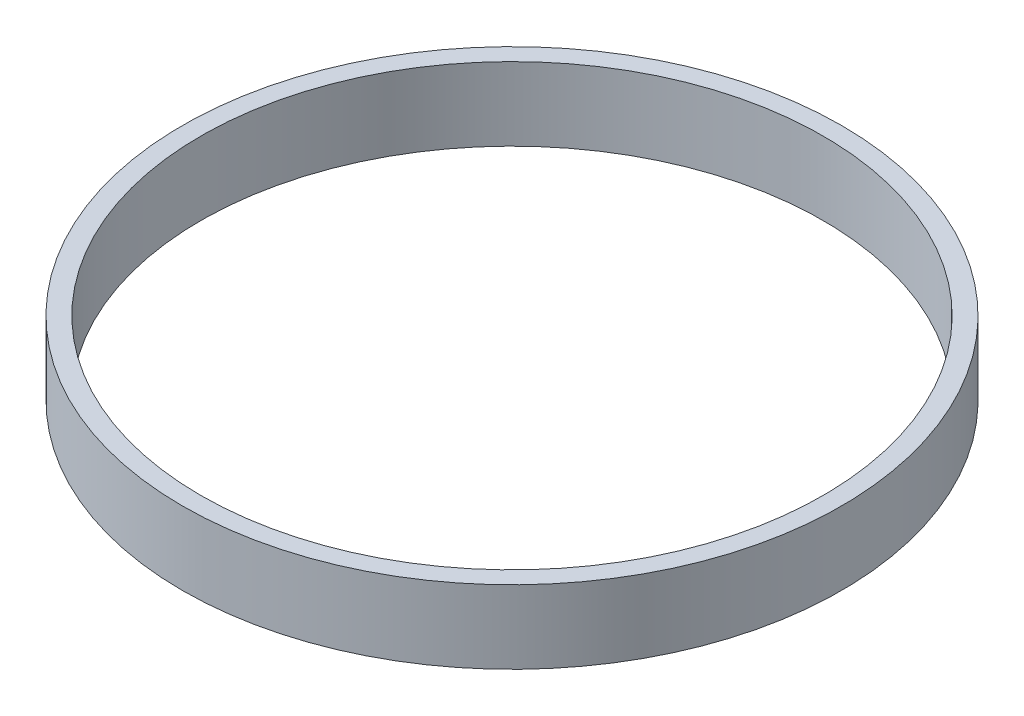
ISO-10303-21;
HEADER;
FILE_DESCRIPTION(('STEP AP214'),'2;1');
FILE_NAME('part.step','',(''),(''),'','','');
FILE_SCHEMA(('AUTOMOTIVE_DESIGN { 1 0 10303 214 1 1 1 1 }'));
ENDSEC;
DATA;
#1=APPLICATION_CONTEXT('core data for automotive mechanical design processes');
#2=APPLICATION_PROTOCOL_DEFINITION('international standard','automotive_design',2000,#1);
#3=PRODUCT_CONTEXT('',#1,'mechanical');
#4=PRODUCT('Part','Part','',(#3));
#5=PRODUCT_RELATED_PRODUCT_CATEGORY('part','',(#4));
#6=PRODUCT_DEFINITION_FORMATION('','',#4);
#7=PRODUCT_DEFINITION_CONTEXT('part definition',#1,'design');
#8=PRODUCT_DEFINITION('design','',#6,#7);
#9=PRODUCT_DEFINITION_SHAPE('','',#8);
#10=(LENGTH_UNIT() NAMED_UNIT(*) SI_UNIT(.MILLI.,.METRE.));
#11=(NAMED_UNIT(*) PLANE_ANGLE_UNIT() SI_UNIT($,.RADIAN.));
#12=(NAMED_UNIT(*) SI_UNIT($,.STERADIAN.) SOLID_ANGLE_UNIT());
#13=UNCERTAINTY_MEASURE_WITH_UNIT(LENGTH_MEASURE(1.E-05),#10,'distance_accuracy_value','');
#14=(GEOMETRIC_REPRESENTATION_CONTEXT(3) GLOBAL_UNCERTAINTY_ASSIGNED_CONTEXT((#13)) GLOBAL_UNIT_ASSIGNED_CONTEXT((#10,
#11,#12)) REPRESENTATION_CONTEXT('',''));
#15=CARTESIAN_POINT('',(0.,0.,0.));
#16=DIRECTION('',(0.,0.,1.));
#17=DIRECTION('',(1.,0.,0.));
#18=AXIS2_PLACEMENT_3D('',#15,#16,#17);
#19=CARTESIAN_POINT('',(0.,10.,0.));
#20=DIRECTION('',(0.,-1.,0.));
#21=DIRECTION('',(0.,0.,-1.));
#22=AXIS2_PLACEMENT_3D('',#19,#20,#21);
#23=CYLINDRICAL_SURFACE('',#22,45.);
#24=CARTESIAN_POINT('',(0.,10.,0.));
#25=DIRECTION('',(0.,1.,0.));
#26=DIRECTION('',(0.,0.,1.));
#27=AXIS2_PLACEMENT_3D('',#24,#25,#26);
#28=CIRCLE('',#27,45.);
#29=CARTESIAN_POINT('',(0.,10.,45.));
#30=VERTEX_POINT('',#29);
#31=EDGE_CURVE('E10',#30,#30,#28,.T.);
#32=ORIENTED_EDGE('',*,*,#31,.F.);
#33=EDGE_LOOP('',(#32));
#34=FACE_BOUND('',#33,.T.);
#35=CARTESIAN_POINT('',(0.,0.,0.));
#36=DIRECTION('',(0.,1.,0.));
#37=DIRECTION('',(0.,0.,1.));
#38=AXIS2_PLACEMENT_3D('',#35,#36,#37);
#39=CIRCLE('',#38,45.);
#40=CARTESIAN_POINT('',(0.,0.,45.));
#41=VERTEX_POINT('',#40);
#42=EDGE_CURVE('E42',#41,#41,#39,.T.);
#43=ORIENTED_EDGE('',*,*,#42,.T.);
#44=EDGE_LOOP('',(#43));
#45=FACE_BOUND('',#44,.T.);
#46=ADVANCED_FACE('F35',(#34,#45),#23,.T.);
#47=CARTESIAN_POINT('',(0.,10.,0.));
#48=DIRECTION('',(0.,1.,0.));
#49=DIRECTION('',(0.,0.,1.));
#50=AXIS2_PLACEMENT_3D('',#47,#48,#49);
#51=PLANE('',#50);
#52=CARTESIAN_POINT('',(0.,10.,0.));
#53=DIRECTION('',(0.,1.,0.));
#54=DIRECTION('',(0.,0.,1.));
#55=AXIS2_PLACEMENT_3D('',#52,#53,#54);
#56=CIRCLE('',#55,42.5);
#57=CARTESIAN_POINT('',(0.,10.,42.5));
#58=VERTEX_POINT('',#57);
#59=EDGE_CURVE('E48',#58,#58,#56,.T.);
#60=ORIENTED_EDGE('',*,*,#59,.F.);
#61=EDGE_LOOP('',(#60));
#62=FACE_BOUND('',#61,.T.);
#63=ORIENTED_EDGE('',*,*,#31,.T.);
#64=EDGE_LOOP('',(#63));
#65=FACE_BOUND('',#64,.T.);
#66=ADVANCED_FACE('F64',(#62,#65),#51,.T.);
#67=CARTESIAN_POINT('',(0.,0.,0.));
#68=DIRECTION('',(0.,1.,0.));
#69=DIRECTION('',(0.,0.,1.));
#70=AXIS2_PLACEMENT_3D('',#67,#68,#69);
#71=PLANE('',#70);
#72=CARTESIAN_POINT('',(0.,0.,0.));
#73=DIRECTION('',(0.,1.,0.));
#74=DIRECTION('',(0.,0.,1.));
#75=AXIS2_PLACEMENT_3D('',#72,#73,#74);
#76=CIRCLE('',#75,42.5);
#77=CARTESIAN_POINT('',(0.,0.,42.5));
#78=VERTEX_POINT('',#77);
#79=EDGE_CURVE('E38',#78,#78,#76,.T.);
#80=ORIENTED_EDGE('',*,*,#79,.T.);
#81=EDGE_LOOP('',(#80));
#82=FACE_BOUND('',#81,.T.);
#83=ORIENTED_EDGE('',*,*,#42,.F.);
#84=EDGE_LOOP('',(#83));
#85=FACE_BOUND('',#84,.T.);
#86=ADVANCED_FACE('F55',(#82,#85),#71,.F.);
#87=CARTESIAN_POINT('',(0.,-10.35,0.));
#88=DIRECTION('',(0.,1.,0.));
#89=DIRECTION('',(0.,0.,1.));
#90=AXIS2_PLACEMENT_3D('',#87,#88,#89);
#91=CYLINDRICAL_SURFACE('',#90,42.5);
#92=ORIENTED_EDGE('',*,*,#59,.T.);
#93=EDGE_LOOP('',(#92));
#94=FACE_BOUND('',#93,.T.);
#95=ORIENTED_EDGE('',*,*,#79,.F.);
#96=EDGE_LOOP('',(#95));
#97=FACE_BOUND('',#96,.T.);
#98=ADVANCED_FACE('F58',(#94,#97),#91,.F.);
#99=CLOSED_SHELL('',(#46,#66,#86,#98));
#100=MANIFOLD_SOLID_BREP('B2',#99);
#101=ADVANCED_BREP_SHAPE_REPRESENTATION('',(#18,#100),#14);
#102=SHAPE_DEFINITION_REPRESENTATION(#9,#101);
ENDSEC;
END-ISO-10303-21;
